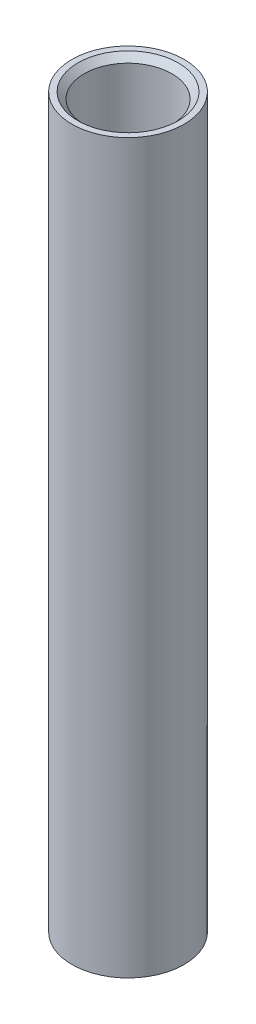
ISO-10303-21;
HEADER;
FILE_DESCRIPTION(('STEP AP214'),'2;1');
FILE_NAME('part.step','',(''),(''),'','','');
FILE_SCHEMA(('AUTOMOTIVE_DESIGN { 1 0 10303 214 1 1 1 1 }'));
ENDSEC;
DATA;
#1=APPLICATION_CONTEXT('core data for automotive mechanical design processes');
#2=APPLICATION_PROTOCOL_DEFINITION('international standard','automotive_design',2000,#1);
#3=PRODUCT_CONTEXT('',#1,'mechanical');
#4=PRODUCT('Part','Part','',(#3));
#5=PRODUCT_RELATED_PRODUCT_CATEGORY('part','',(#4));
#6=PRODUCT_DEFINITION_FORMATION('','',#4);
#7=PRODUCT_DEFINITION_CONTEXT('part definition',#1,'design');
#8=PRODUCT_DEFINITION('design','',#6,#7);
#9=PRODUCT_DEFINITION_SHAPE('','',#8);
#10=(LENGTH_UNIT() NAMED_UNIT(*) SI_UNIT(.MILLI.,.METRE.));
#11=(NAMED_UNIT(*) PLANE_ANGLE_UNIT() SI_UNIT($,.RADIAN.));
#12=(NAMED_UNIT(*) SI_UNIT($,.STERADIAN.) SOLID_ANGLE_UNIT());
#13=UNCERTAINTY_MEASURE_WITH_UNIT(LENGTH_MEASURE(1.E-05),#10,'distance_accuracy_value','');
#14=(GEOMETRIC_REPRESENTATION_CONTEXT(3) GLOBAL_UNCERTAINTY_ASSIGNED_CONTEXT((#13)) GLOBAL_UNIT_ASSIGNED_CONTEXT((#10,
#11,#12)) REPRESENTATION_CONTEXT('',''));
#15=CARTESIAN_POINT('',(0.,0.,0.));
#16=DIRECTION('',(0.,0.,1.));
#17=DIRECTION('',(1.,0.,0.));
#18=AXIS2_PLACEMENT_3D('',#15,#16,#17);
#19=CARTESIAN_POINT('',(0.,-62.5000345383906,0.));
#20=DIRECTION('',(0.,-1.,0.));
#21=DIRECTION('',(0.,0.,-1.));
#22=AXIS2_PLACEMENT_3D('',#19,#20,#21);
#23=CONICAL_SURFACE('',#22,3.49997437818907,0.785389569087494);
#24=CARTESIAN_POINT('',(0.,-62.5000601606419,0.));
#25=DIRECTION('',(0.,-1.,0.));
#26=DIRECTION('',(0.,0.,-1.));
#27=AXIS2_PLACEMENT_3D('',#24,#25,#26);
#28=CIRCLE('',#27,3.5);
#29=CARTESIAN_POINT('',(0.,-62.5000601606419,-3.5));
#30=VERTEX_POINT('',#29);
#31=EDGE_CURVE('E47',#30,#30,#28,.F.);
#32=ORIENTED_EDGE('',*,*,#31,.T.);
#33=EDGE_LOOP('',(#32));
#34=FACE_BOUND('',#33,.T.);
#35=CARTESIAN_POINT('',(0.,-63.,0.));
#36=DIRECTION('',(0.,-1.,0.));
#37=DIRECTION('',(0.,0.,-1.));
#38=AXIS2_PLACEMENT_3D('',#35,#36,#37);
#39=CIRCLE('',#38,3.99993124615607);
#40=CARTESIAN_POINT('',(0.,-63.,-3.99993124615607));
#41=VERTEX_POINT('',#40);
#42=EDGE_CURVE('E26',#41,#41,#39,.T.);
#43=ORIENTED_EDGE('',*,*,#42,.T.);
#44=EDGE_LOOP('',(#43));
#45=FACE_BOUND('',#44,.T.);
#46=ADVANCED_FACE('F22',(#34,#45),#23,.F.);
#47=CARTESIAN_POINT('',(-4.654,-63.,-4.654));
#48=DIRECTION('',(0.,-1.,0.));
#49=DIRECTION('',(1.,0.,0.));
#50=AXIS2_PLACEMENT_3D('',#47,#48,#49);
#51=PLANE('',#50);
#52=ORIENTED_EDGE('',*,*,#42,.F.);
#53=EDGE_LOOP('',(#52));
#54=FACE_BOUND('',#53,.T.);
#55=CARTESIAN_POINT('',(0.,-63.,0.));
#56=DIRECTION('',(0.,-1.,0.));
#57=DIRECTION('',(0.,0.,-1.));
#58=AXIS2_PLACEMENT_3D('',#55,#56,#57);
#59=CIRCLE('',#58,4.475);
#60=CARTESIAN_POINT('',(0.,-63.,-4.47499999999999));
#61=VERTEX_POINT('',#60);
#62=EDGE_CURVE('E44',#61,#61,#59,.T.);
#63=ORIENTED_EDGE('',*,*,#62,.T.);
#64=EDGE_LOOP('',(#63));
#65=FACE_BOUND('',#64,.T.);
#66=ADVANCED_FACE('F57',(#54,#65),#51,.T.);
#67=CARTESIAN_POINT('',(0.,-5.499991082981,0.));
#68=DIRECTION('',(0.,-1.,0.));
#69=DIRECTION('',(0.,0.,-1.));
#70=AXIS2_PLACEMENT_3D('',#67,#68,#69);
#71=CYLINDRICAL_SURFACE('',#70,3.5);
#72=CARTESIAN_POINT('',(0.,-5.49993983935467,0.));
#73=DIRECTION('',(0.,1.,0.));
#74=DIRECTION('',(0.,0.,1.));
#75=AXIS2_PLACEMENT_3D('',#72,#73,#74);
#76=CIRCLE('',#75,3.5);
#77=CARTESIAN_POINT('',(0.,-5.49993983935467,3.5));
#78=VERTEX_POINT('',#77);
#79=EDGE_CURVE('E39',#78,#78,#76,.T.);
#80=ORIENTED_EDGE('',*,*,#79,.T.);
#81=EDGE_LOOP('',(#80));
#82=FACE_BOUND('',#81,.T.);
#83=ORIENTED_EDGE('',*,*,#31,.F.);
#84=EDGE_LOOP('',(#83));
#85=FACE_BOUND('',#84,.T.);
#86=ADVANCED_FACE('F60',(#82,#85),#71,.F.);
#87=CARTESIAN_POINT('',(0.,-5.,0.));
#88=DIRECTION('',(0.,-1.,0.));
#89=DIRECTION('',(0.,0.,-1.));
#90=AXIS2_PLACEMENT_3D('',#87,#88,#89);
#91=CYLINDRICAL_SURFACE('',#90,4.475);
#92=ORIENTED_EDGE('',*,*,#62,.F.);
#93=EDGE_LOOP('',(#92));
#94=FACE_BOUND('',#93,.T.);
#95=CARTESIAN_POINT('',(0.,-5.,0.));
#96=DIRECTION('',(0.,-1.,0.));
#97=DIRECTION('',(0.,0.,-1.));
#98=AXIS2_PLACEMENT_3D('',#95,#96,#97);
#99=CIRCLE('',#98,4.475);
#100=CARTESIAN_POINT('',(0.,-5.,-4.475));
#101=VERTEX_POINT('',#100);
#102=EDGE_CURVE('E31',#101,#101,#99,.T.);
#103=ORIENTED_EDGE('',*,*,#102,.T.);
#104=EDGE_LOOP('',(#103));
#105=FACE_BOUND('',#104,.T.);
#106=ADVANCED_FACE('F63',(#94,#105),#91,.T.);
#107=CARTESIAN_POINT('',(0.,-5.49996546160824,0.));
#108=DIRECTION('',(0.,1.,0.));
#109=DIRECTION('',(0.,0.,1.));
#110=AXIS2_PLACEMENT_3D('',#107,#108,#109);
#111=CONICAL_SURFACE('',#110,3.49997437818684,0.785389569093323);
#112=ORIENTED_EDGE('',*,*,#79,.F.);
#113=EDGE_LOOP('',(#112));
#114=FACE_BOUND('',#113,.T.);
#115=CARTESIAN_POINT('',(0.,-5.,0.));
#116=DIRECTION('',(0.,-1.,0.));
#117=DIRECTION('',(0.,0.,-1.));
#118=AXIS2_PLACEMENT_3D('',#115,#116,#117);
#119=CIRCLE('',#118,3.99993124615847);
#120=CARTESIAN_POINT('',(0.,-5.,-3.99993124615847));
#121=VERTEX_POINT('',#120);
#122=EDGE_CURVE('E12',#121,#121,#119,.F.);
#123=ORIENTED_EDGE('',*,*,#122,.T.);
#124=EDGE_LOOP('',(#123));
#125=FACE_BOUND('',#124,.T.);
#126=ADVANCED_FACE('F66',(#114,#125),#111,.F.);
#127=CARTESIAN_POINT('',(-4.654,-5.,-4.654));
#128=DIRECTION('',(0.,-1.,0.));
#129=DIRECTION('',(1.,0.,0.));
#130=AXIS2_PLACEMENT_3D('',#127,#128,#129);
#131=PLANE('',#130);
#132=ORIENTED_EDGE('',*,*,#122,.F.);
#133=EDGE_LOOP('',(#132));
#134=FACE_BOUND('',#133,.T.);
#135=ORIENTED_EDGE('',*,*,#102,.F.);
#136=EDGE_LOOP('',(#135));
#137=FACE_BOUND('',#136,.T.);
#138=ADVANCED_FACE('F24',(#134,#137),#131,.F.);
#139=CLOSED_SHELL('',(#46,#66,#86,#106,#126,#138));
#140=MANIFOLD_SOLID_BREP('B1',#139);
#141=ADVANCED_BREP_SHAPE_REPRESENTATION('',(#18,#140),#14);
#142=SHAPE_DEFINITION_REPRESENTATION(#9,#141);
ENDSEC;
END-ISO-10303-21;
